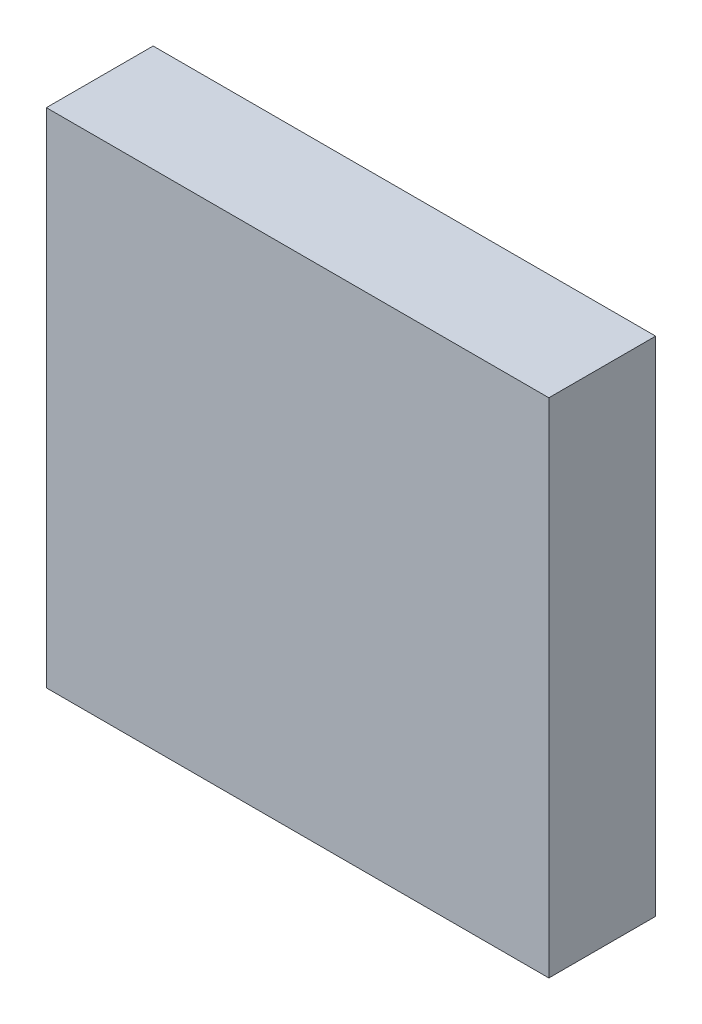
ISO-10303-21;
HEADER;
FILE_DESCRIPTION(('STEP AP214'),'2;1');
FILE_NAME('part.step','',(''),(''),'','','');
FILE_SCHEMA(('AUTOMOTIVE_DESIGN { 1 0 10303 214 1 1 1 1 }'));
ENDSEC;
DATA;
#1=APPLICATION_CONTEXT('core data for automotive mechanical design processes');
#2=APPLICATION_PROTOCOL_DEFINITION('international standard','automotive_design',2000,#1);
#3=PRODUCT_CONTEXT('',#1,'mechanical');
#4=PRODUCT('Part','Part','',(#3));
#5=PRODUCT_RELATED_PRODUCT_CATEGORY('part','',(#4));
#6=PRODUCT_DEFINITION_FORMATION('','',#4);
#7=PRODUCT_DEFINITION_CONTEXT('part definition',#1,'design');
#8=PRODUCT_DEFINITION('design','',#6,#7);
#9=PRODUCT_DEFINITION_SHAPE('','',#8);
#10=(LENGTH_UNIT() NAMED_UNIT(*) SI_UNIT(.MILLI.,.METRE.));
#11=(NAMED_UNIT(*) PLANE_ANGLE_UNIT() SI_UNIT($,.RADIAN.));
#12=(NAMED_UNIT(*) SI_UNIT($,.STERADIAN.) SOLID_ANGLE_UNIT());
#13=UNCERTAINTY_MEASURE_WITH_UNIT(LENGTH_MEASURE(1.E-05),#10,'distance_accuracy_value','');
#14=(GEOMETRIC_REPRESENTATION_CONTEXT(3) GLOBAL_UNCERTAINTY_ASSIGNED_CONTEXT((#13)) GLOBAL_UNIT_ASSIGNED_CONTEXT((#10,
#11,#12)) REPRESENTATION_CONTEXT('',''));
#15=CARTESIAN_POINT('',(0.,0.,0.));
#16=DIRECTION('',(0.,0.,1.));
#17=DIRECTION('',(1.,0.,0.));
#18=AXIS2_PLACEMENT_3D('',#15,#16,#17);
#19=CARTESIAN_POINT('',(2.00000108,-1.99999854,0.85000084));
#20=DIRECTION('',(0.,0.,-1.));
#21=DIRECTION('',(-1.,0.,0.));
#22=AXIS2_PLACEMENT_3D('',#19,#20,#21);
#23=PLANE('',#22);
#24=DIRECTION('',(1.,0.,0.));
#25=VECTOR('',#24,1.);
#26=CARTESIAN_POINT('',(2.00000108,2.00000108,0.85000084));
#27=LINE('',#26,#25);
#28=CARTESIAN_POINT('',(2.00000108,2.00000108,0.85000084));
#29=VERTEX_POINT('',#28);
#30=CARTESIAN_POINT('',(-1.99999854,2.00000108,0.85000084));
#31=VERTEX_POINT('',#30);
#32=EDGE_CURVE('E54',#29,#31,#27,.F.);
#33=ORIENTED_EDGE('',*,*,#32,.T.);
#34=DIRECTION('',(0.,1.,0.));
#35=VECTOR('',#34,1.);
#36=CARTESIAN_POINT('',(-1.99999854,2.00000108,0.85000084));
#37=LINE('',#36,#35);
#38=CARTESIAN_POINT('',(-1.99999854,-1.99999854,0.85000084));
#39=VERTEX_POINT('',#38);
#40=EDGE_CURVE('E56',#31,#39,#37,.F.);
#41=ORIENTED_EDGE('',*,*,#40,.T.);
#42=DIRECTION('',(1.,0.,0.));
#43=VECTOR('',#42,1.);
#44=CARTESIAN_POINT('',(-1.99999854,-1.99999854,0.85000084));
#45=LINE('',#44,#43);
#46=CARTESIAN_POINT('',(2.00000108,-1.99999854,0.85000084));
#47=VERTEX_POINT('',#46);
#48=EDGE_CURVE('E19',#39,#47,#45,.T.);
#49=ORIENTED_EDGE('',*,*,#48,.T.);
#50=DIRECTION('',(0.,1.,0.));
#51=VECTOR('',#50,1.);
#52=CARTESIAN_POINT('',(2.00000108,-1.99999854,0.85000084));
#53=LINE('',#52,#51);
#54=EDGE_CURVE('E79',#47,#29,#53,.T.);
#55=ORIENTED_EDGE('',*,*,#54,.T.);
#56=EDGE_LOOP('',(#33,#41,#49,#55));
#57=FACE_BOUND('',#56,.T.);
#58=ADVANCED_FACE('F16',(#57),#23,.F.);
#59=CARTESIAN_POINT('',(-1.99999854,-1.99999854,0.));
#60=DIRECTION('',(0.,1.,0.));
#61=DIRECTION('',(0.,0.,1.));
#62=AXIS2_PLACEMENT_3D('',#59,#60,#61);
#63=PLANE('',#62);
#64=DIRECTION('',(0.,0.,1.));
#65=VECTOR('',#64,1.);
#66=CARTESIAN_POINT('',(2.00000108,-1.99999854,0.));
#67=LINE('',#66,#65);
#68=CARTESIAN_POINT('',(2.00000108,-1.99999854,0.));
#69=VERTEX_POINT('',#68);
#70=EDGE_CURVE('E67',#69,#47,#67,.T.);
#71=ORIENTED_EDGE('',*,*,#70,.T.);
#72=ORIENTED_EDGE('',*,*,#48,.F.);
#73=DIRECTION('',(0.,0.,-1.));
#74=VECTOR('',#73,1.);
#75=CARTESIAN_POINT('',(-1.99999854,-1.99999854,0.));
#76=LINE('',#75,#74);
#77=CARTESIAN_POINT('',(-1.99999854,-1.99999854,0.));
#78=VERTEX_POINT('',#77);
#79=EDGE_CURVE('E62',#39,#78,#76,.T.);
#80=ORIENTED_EDGE('',*,*,#79,.T.);
#81=DIRECTION('',(-1.,0.,0.));
#82=VECTOR('',#81,1.);
#83=CARTESIAN_POINT('',(2.00000108,-1.99999854,0.));
#84=LINE('',#83,#82);
#85=EDGE_CURVE('E82',#69,#78,#84,.T.);
#86=ORIENTED_EDGE('',*,*,#85,.F.);
#87=EDGE_LOOP('',(#71,#72,#80,#86));
#88=FACE_BOUND('',#87,.T.);
#89=ADVANCED_FACE('F64',(#88),#63,.F.);
#90=CARTESIAN_POINT('',(-1.99999854,2.00000108,0.));
#91=DIRECTION('',(1.,0.,0.));
#92=DIRECTION('',(0.,0.,-1.));
#93=AXIS2_PLACEMENT_3D('',#90,#91,#92);
#94=PLANE('',#93);
#95=ORIENTED_EDGE('',*,*,#79,.F.);
#96=ORIENTED_EDGE('',*,*,#40,.F.);
#97=DIRECTION('',(0.,0.,-1.));
#98=VECTOR('',#97,1.);
#99=CARTESIAN_POINT('',(-1.99999854,2.00000108,0.));
#100=LINE('',#99,#98);
#101=CARTESIAN_POINT('',(-1.99999854,2.00000108,0.));
#102=VERTEX_POINT('',#101);
#103=EDGE_CURVE('E74',#31,#102,#100,.T.);
#104=ORIENTED_EDGE('',*,*,#103,.T.);
#105=DIRECTION('',(0.,1.,0.));
#106=VECTOR('',#105,1.);
#107=CARTESIAN_POINT('',(-1.99999854,-1.99999854,0.));
#108=LINE('',#107,#106);
#109=EDGE_CURVE('E71',#78,#102,#108,.T.);
#110=ORIENTED_EDGE('',*,*,#109,.F.);
#111=EDGE_LOOP('',(#95,#96,#104,#110));
#112=FACE_BOUND('',#111,.T.);
#113=ADVANCED_FACE('F69',(#112),#94,.F.);
#114=CARTESIAN_POINT('',(2.00000108,2.00000108,0.));
#115=DIRECTION('',(0.,-1.,0.));
#116=DIRECTION('',(0.,0.,-1.));
#117=AXIS2_PLACEMENT_3D('',#114,#115,#116);
#118=PLANE('',#117);
#119=ORIENTED_EDGE('',*,*,#103,.F.);
#120=ORIENTED_EDGE('',*,*,#32,.F.);
#121=DIRECTION('',(0.,0.,1.));
#122=VECTOR('',#121,1.);
#123=CARTESIAN_POINT('',(2.00000108,2.00000108,0.));
#124=LINE('',#123,#122);
#125=CARTESIAN_POINT('',(2.00000108,2.00000108,0.));
#126=VERTEX_POINT('',#125);
#127=EDGE_CURVE('E34',#29,#126,#124,.F.);
#128=ORIENTED_EDGE('',*,*,#127,.T.);
#129=DIRECTION('',(-1.,0.,0.));
#130=VECTOR('',#129,1.);
#131=CARTESIAN_POINT('',(2.00000108,2.00000108,0.));
#132=LINE('',#131,#130);
#133=EDGE_CURVE('E25',#102,#126,#132,.F.);
#134=ORIENTED_EDGE('',*,*,#133,.F.);
#135=EDGE_LOOP('',(#119,#120,#128,#134));
#136=FACE_BOUND('',#135,.T.);
#137=ADVANCED_FACE('F88',(#136),#118,.F.);
#138=CARTESIAN_POINT('',(2.00000108,-1.99999854,0.));
#139=DIRECTION('',(-1.,0.,0.));
#140=DIRECTION('',(0.,0.,1.));
#141=AXIS2_PLACEMENT_3D('',#138,#139,#140);
#142=PLANE('',#141);
#143=ORIENTED_EDGE('',*,*,#127,.F.);
#144=ORIENTED_EDGE('',*,*,#54,.F.);
#145=ORIENTED_EDGE('',*,*,#70,.F.);
#146=DIRECTION('',(0.,1.,0.));
#147=VECTOR('',#146,1.);
#148=CARTESIAN_POINT('',(2.00000108,-1.99999854,0.));
#149=LINE('',#148,#147);
#150=EDGE_CURVE('E10',#126,#69,#149,.F.);
#151=ORIENTED_EDGE('',*,*,#150,.F.);
#152=EDGE_LOOP('',(#143,#144,#145,#151));
#153=FACE_BOUND('',#152,.T.);
#154=ADVANCED_FACE('F90',(#153),#142,.F.);
#155=CARTESIAN_POINT('',(2.00000108,-1.99999854,0.));
#156=DIRECTION('',(0.,0.,-1.));
#157=DIRECTION('',(-1.,0.,0.));
#158=AXIS2_PLACEMENT_3D('',#155,#156,#157);
#159=PLANE('',#158);
#160=ORIENTED_EDGE('',*,*,#133,.T.);
#161=ORIENTED_EDGE('',*,*,#150,.T.);
#162=ORIENTED_EDGE('',*,*,#85,.T.);
#163=ORIENTED_EDGE('',*,*,#109,.T.);
#164=EDGE_LOOP('',(#160,#161,#162,#163));
#165=FACE_BOUND('',#164,.T.);
#166=ADVANCED_FACE('F87',(#165),#159,.T.);
#167=CLOSED_SHELL('',(#58,#89,#113,#137,#154,#166));
#168=MANIFOLD_SOLID_BREP('B1',#167);
#169=ADVANCED_BREP_SHAPE_REPRESENTATION('',(#18,#168),#14);
#170=SHAPE_DEFINITION_REPRESENTATION(#9,#169);
ENDSEC;
END-ISO-10303-21;
